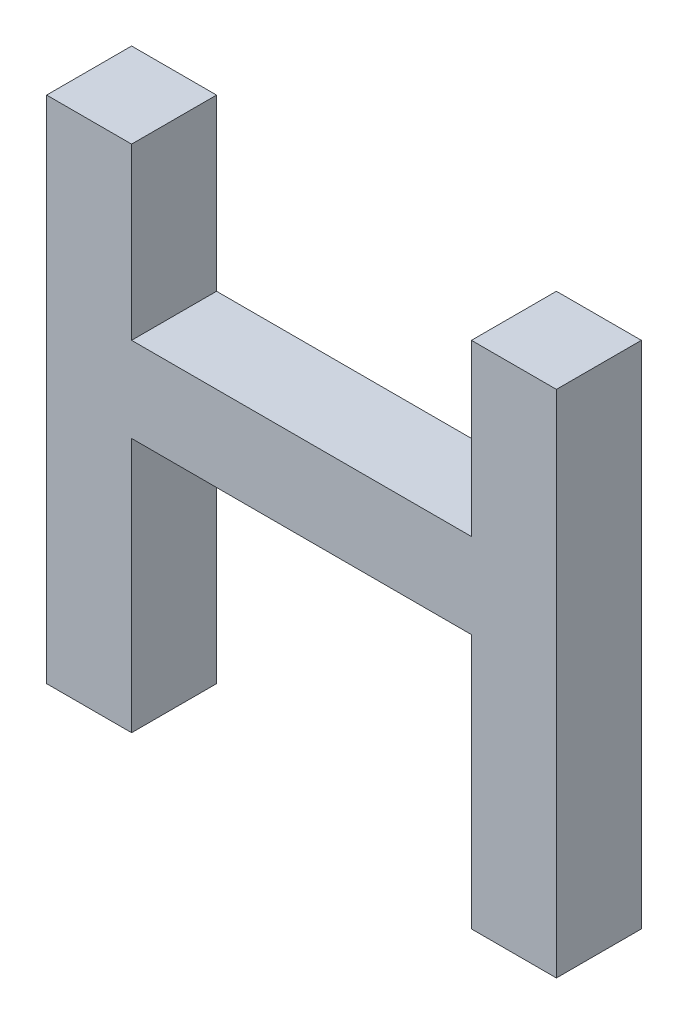
ISO-10303-21;
HEADER;
FILE_DESCRIPTION(('STEP AP214'),'2;1');
FILE_NAME('part.step','',(''),(''),'','','');
FILE_SCHEMA(('AUTOMOTIVE_DESIGN { 1 0 10303 214 1 1 1 1 }'));
ENDSEC;
DATA;
#1=APPLICATION_CONTEXT('core data for automotive mechanical design processes');
#2=APPLICATION_PROTOCOL_DEFINITION('international standard','automotive_design',2000,#1);
#3=PRODUCT_CONTEXT('',#1,'mechanical');
#4=PRODUCT('Part','Part','',(#3));
#5=PRODUCT_RELATED_PRODUCT_CATEGORY('part','',(#4));
#6=PRODUCT_DEFINITION_FORMATION('','',#4);
#7=PRODUCT_DEFINITION_CONTEXT('part definition',#1,'design');
#8=PRODUCT_DEFINITION('design','',#6,#7);
#9=PRODUCT_DEFINITION_SHAPE('','',#8);
#10=(LENGTH_UNIT() NAMED_UNIT(*) SI_UNIT(.MILLI.,.METRE.));
#11=(NAMED_UNIT(*) PLANE_ANGLE_UNIT() SI_UNIT($,.RADIAN.));
#12=(NAMED_UNIT(*) SI_UNIT($,.STERADIAN.) SOLID_ANGLE_UNIT());
#13=UNCERTAINTY_MEASURE_WITH_UNIT(LENGTH_MEASURE(1.E-05),#10,'distance_accuracy_value','');
#14=(GEOMETRIC_REPRESENTATION_CONTEXT(3) GLOBAL_UNCERTAINTY_ASSIGNED_CONTEXT((#13)) GLOBAL_UNIT_ASSIGNED_CONTEXT((#10,
#11,#12)) REPRESENTATION_CONTEXT('',''));
#15=CARTESIAN_POINT('',(0.,0.,0.));
#16=DIRECTION('',(0.,0.,1.));
#17=DIRECTION('',(1.,0.,0.));
#18=AXIS2_PLACEMENT_3D('',#15,#16,#17);
#19=CARTESIAN_POINT('',(-50.8,0.,25.4));
#20=DIRECTION('',(-1.,0.,0.));
#21=DIRECTION('',(0.,-1.,0.));
#22=AXIS2_PLACEMENT_3D('',#19,#20,#21);
#23=PLANE('',#22);
#24=DIRECTION('',(0.,1.,0.));
#25=VECTOR('',#24,1.);
#26=CARTESIAN_POINT('',(-50.8,0.,0.));
#27=LINE('',#26,#25);
#28=CARTESIAN_POINT('',(-50.8,-76.2,0.));
#29=VERTEX_POINT('',#28);
#30=CARTESIAN_POINT('',(-50.8,0.,0.));
#31=VERTEX_POINT('',#30);
#32=EDGE_CURVE('E154',#29,#31,#27,.T.);
#33=ORIENTED_EDGE('',*,*,#32,.T.);
#34=DIRECTION('',(0.,0.,-1.));
#35=VECTOR('',#34,1.);
#36=CARTESIAN_POINT('',(-50.8,0.,25.4));
#37=LINE('',#36,#35);
#38=CARTESIAN_POINT('',(-50.8,0.,25.4));
#39=VERTEX_POINT('',#38);
#40=EDGE_CURVE('E11',#39,#31,#37,.T.);
#41=ORIENTED_EDGE('',*,*,#40,.F.);
#42=DIRECTION('',(0.,1.,0.));
#43=VECTOR('',#42,1.);
#44=CARTESIAN_POINT('',(-50.8,0.,25.4));
#45=LINE('',#44,#43);
#46=CARTESIAN_POINT('',(-50.8,-76.2,25.4));
#47=VERTEX_POINT('',#46);
#48=EDGE_CURVE('E176',#47,#39,#45,.T.);
#49=ORIENTED_EDGE('',*,*,#48,.F.);
#50=DIRECTION('',(0.,0.,-1.));
#51=VECTOR('',#50,1.);
#52=CARTESIAN_POINT('',(-50.8,-76.2,25.4));
#53=LINE('',#52,#51);
#54=EDGE_CURVE('E150',#47,#29,#53,.T.);
#55=ORIENTED_EDGE('',*,*,#54,.T.);
#56=EDGE_LOOP('',(#33,#41,#49,#55));
#57=FACE_BOUND('',#56,.T.);
#58=ADVANCED_FACE('F34',(#57),#23,.F.);
#59=CARTESIAN_POINT('',(50.8,0.,25.4));
#60=DIRECTION('',(0.,1.,0.));
#61=DIRECTION('',(0.,0.,1.));
#62=AXIS2_PLACEMENT_3D('',#59,#60,#61);
#63=PLANE('',#62);
#64=DIRECTION('',(1.,0.,0.));
#65=VECTOR('',#64,1.);
#66=CARTESIAN_POINT('',(50.8,0.,0.));
#67=LINE('',#66,#65);
#68=CARTESIAN_POINT('',(50.8,0.,0.));
#69=VERTEX_POINT('',#68);
#70=EDGE_CURVE('E157',#31,#69,#67,.T.);
#71=ORIENTED_EDGE('',*,*,#70,.T.);
#72=DIRECTION('',(0.,0.,-1.));
#73=VECTOR('',#72,1.);
#74=CARTESIAN_POINT('',(50.8,0.,25.4));
#75=LINE('',#74,#73);
#76=CARTESIAN_POINT('',(50.8,0.,25.4));
#77=VERTEX_POINT('',#76);
#78=EDGE_CURVE('E42',#77,#69,#75,.T.);
#79=ORIENTED_EDGE('',*,*,#78,.F.);
#80=DIRECTION('',(1.,0.,0.));
#81=VECTOR('',#80,1.);
#82=CARTESIAN_POINT('',(50.8,0.,25.4));
#83=LINE('',#82,#81);
#84=EDGE_CURVE('E105',#39,#77,#83,.T.);
#85=ORIENTED_EDGE('',*,*,#84,.F.);
#86=ORIENTED_EDGE('',*,*,#40,.T.);
#87=EDGE_LOOP('',(#71,#79,#85,#86));
#88=FACE_BOUND('',#87,.T.);
#89=ADVANCED_FACE('F254',(#88),#63,.F.);
#90=CARTESIAN_POINT('',(50.8,0.,25.4));
#91=DIRECTION('',(1.,0.,0.));
#92=DIRECTION('',(0.,1.,0.));
#93=AXIS2_PLACEMENT_3D('',#90,#91,#92);
#94=PLANE('',#93);
#95=DIRECTION('',(0.,-1.,0.));
#96=VECTOR('',#95,1.);
#97=CARTESIAN_POINT('',(50.8,0.,0.));
#98=LINE('',#97,#96);
#99=CARTESIAN_POINT('',(50.8,-76.2,0.));
#100=VERTEX_POINT('',#99);
#101=EDGE_CURVE('E159',#69,#100,#98,.T.);
#102=ORIENTED_EDGE('',*,*,#101,.T.);
#103=DIRECTION('',(0.,0.,-1.));
#104=VECTOR('',#103,1.);
#105=CARTESIAN_POINT('',(50.8,-76.2,25.4));
#106=LINE('',#105,#104);
#107=CARTESIAN_POINT('',(50.8,-76.2,25.4));
#108=VERTEX_POINT('',#107);
#109=EDGE_CURVE('E195',#108,#100,#106,.T.);
#110=ORIENTED_EDGE('',*,*,#109,.F.);
#111=DIRECTION('',(0.,-1.,0.));
#112=VECTOR('',#111,1.);
#113=CARTESIAN_POINT('',(50.8,0.,25.4));
#114=LINE('',#113,#112);
#115=EDGE_CURVE('E203',#77,#108,#114,.T.);
#116=ORIENTED_EDGE('',*,*,#115,.F.);
#117=ORIENTED_EDGE('',*,*,#78,.T.);
#118=EDGE_LOOP('',(#102,#110,#116,#117));
#119=FACE_BOUND('',#118,.T.);
#120=ADVANCED_FACE('F201',(#119),#94,.F.);
#121=CARTESIAN_POINT('',(50.8,-76.2,25.4));
#122=DIRECTION('',(0.,1.,0.));
#123=DIRECTION('',(-1.,0.,0.));
#124=AXIS2_PLACEMENT_3D('',#121,#122,#123);
#125=PLANE('',#124);
#126=DIRECTION('',(1.,0.,0.));
#127=VECTOR('',#126,1.);
#128=CARTESIAN_POINT('',(50.8,-76.2,0.));
#129=LINE('',#128,#127);
#130=CARTESIAN_POINT('',(76.2,-76.2,0.));
#131=VERTEX_POINT('',#130);
#132=EDGE_CURVE('E161',#100,#131,#129,.T.);
#133=ORIENTED_EDGE('',*,*,#132,.T.);
#134=DIRECTION('',(0.,0.,-1.));
#135=VECTOR('',#134,1.);
#136=CARTESIAN_POINT('',(76.2,-76.2,25.4));
#137=LINE('',#136,#135);
#138=CARTESIAN_POINT('',(76.2,-76.2,25.4));
#139=VERTEX_POINT('',#138);
#140=EDGE_CURVE('E192',#139,#131,#137,.T.);
#141=ORIENTED_EDGE('',*,*,#140,.F.);
#142=DIRECTION('',(1.,0.,0.));
#143=VECTOR('',#142,1.);
#144=CARTESIAN_POINT('',(50.8,-76.2,25.4));
#145=LINE('',#144,#143);
#146=EDGE_CURVE('E221',#108,#139,#145,.T.);
#147=ORIENTED_EDGE('',*,*,#146,.F.);
#148=ORIENTED_EDGE('',*,*,#109,.T.);
#149=EDGE_LOOP('',(#133,#141,#147,#148));
#150=FACE_BOUND('',#149,.T.);
#151=ADVANCED_FACE('F212',(#150),#125,.F.);
#152=CARTESIAN_POINT('',(76.2,-76.2,25.4));
#153=DIRECTION('',(-1.,0.,0.));
#154=DIRECTION('',(0.,0.,1.));
#155=AXIS2_PLACEMENT_3D('',#152,#153,#154);
#156=PLANE('',#155);
#157=DIRECTION('',(0.,1.,0.));
#158=VECTOR('',#157,1.);
#159=CARTESIAN_POINT('',(76.2,-76.2,0.));
#160=LINE('',#159,#158);
#161=CARTESIAN_POINT('',(76.2,76.2,0.));
#162=VERTEX_POINT('',#161);
#163=EDGE_CURVE('E163',#131,#162,#160,.T.);
#164=ORIENTED_EDGE('',*,*,#163,.T.);
#165=DIRECTION('',(0.,0.,-1.));
#166=VECTOR('',#165,1.);
#167=CARTESIAN_POINT('',(76.2,76.2,25.4));
#168=LINE('',#167,#166);
#169=CARTESIAN_POINT('',(76.2,76.2,25.4));
#170=VERTEX_POINT('',#169);
#171=EDGE_CURVE('E189',#170,#162,#168,.T.);
#172=ORIENTED_EDGE('',*,*,#171,.F.);
#173=DIRECTION('',(0.,1.,0.));
#174=VECTOR('',#173,1.);
#175=CARTESIAN_POINT('',(76.2,-76.2,25.4));
#176=LINE('',#175,#174);
#177=EDGE_CURVE('E218',#139,#170,#176,.T.);
#178=ORIENTED_EDGE('',*,*,#177,.F.);
#179=ORIENTED_EDGE('',*,*,#140,.T.);
#180=EDGE_LOOP('',(#164,#172,#178,#179));
#181=FACE_BOUND('',#180,.T.);
#182=ADVANCED_FACE('F216',(#181),#156,.F.);
#183=CARTESIAN_POINT('',(76.2,76.2,25.4));
#184=DIRECTION('',(0.,-1.,0.));
#185=DIRECTION('',(0.,0.,-1.));
#186=AXIS2_PLACEMENT_3D('',#183,#184,#185);
#187=PLANE('',#186);
#188=DIRECTION('',(-1.,0.,0.));
#189=VECTOR('',#188,1.);
#190=CARTESIAN_POINT('',(76.2,76.2,0.));
#191=LINE('',#190,#189);
#192=CARTESIAN_POINT('',(50.8,76.2,0.));
#193=VERTEX_POINT('',#192);
#194=EDGE_CURVE('E165',#162,#193,#191,.T.);
#195=ORIENTED_EDGE('',*,*,#194,.T.);
#196=DIRECTION('',(0.,0.,-1.));
#197=VECTOR('',#196,1.);
#198=CARTESIAN_POINT('',(50.8,76.2,25.4));
#199=LINE('',#198,#197);
#200=CARTESIAN_POINT('',(50.8,76.2,25.4));
#201=VERTEX_POINT('',#200);
#202=EDGE_CURVE('E186',#201,#193,#199,.T.);
#203=ORIENTED_EDGE('',*,*,#202,.F.);
#204=DIRECTION('',(-1.,0.,0.));
#205=VECTOR('',#204,1.);
#206=CARTESIAN_POINT('',(76.2,76.2,25.4));
#207=LINE('',#206,#205);
#208=EDGE_CURVE('E220',#170,#201,#207,.T.);
#209=ORIENTED_EDGE('',*,*,#208,.F.);
#210=ORIENTED_EDGE('',*,*,#171,.T.);
#211=EDGE_LOOP('',(#195,#203,#209,#210));
#212=FACE_BOUND('',#211,.T.);
#213=ADVANCED_FACE('F267',(#212),#187,.F.);
#214=CARTESIAN_POINT('',(50.8,76.2,25.4));
#215=DIRECTION('',(1.,0.,0.));
#216=DIRECTION('',(0.,0.,-1.));
#217=AXIS2_PLACEMENT_3D('',#214,#215,#216);
#218=PLANE('',#217);
#219=DIRECTION('',(0.,-1.,0.));
#220=VECTOR('',#219,1.);
#221=CARTESIAN_POINT('',(50.8,76.2,0.));
#222=LINE('',#221,#220);
#223=CARTESIAN_POINT('',(50.8,25.4,0.));
#224=VERTEX_POINT('',#223);
#225=EDGE_CURVE('E167',#193,#224,#222,.T.);
#226=ORIENTED_EDGE('',*,*,#225,.T.);
#227=DIRECTION('',(0.,0.,-1.));
#228=VECTOR('',#227,1.);
#229=CARTESIAN_POINT('',(50.8,25.4,25.4));
#230=LINE('',#229,#228);
#231=CARTESIAN_POINT('',(50.8,25.4,25.4));
#232=VERTEX_POINT('',#231);
#233=EDGE_CURVE('E183',#232,#224,#230,.T.);
#234=ORIENTED_EDGE('',*,*,#233,.F.);
#235=DIRECTION('',(0.,-1.,0.));
#236=VECTOR('',#235,1.);
#237=CARTESIAN_POINT('',(50.8,76.2,25.4));
#238=LINE('',#237,#236);
#239=EDGE_CURVE('E223',#201,#232,#238,.T.);
#240=ORIENTED_EDGE('',*,*,#239,.F.);
#241=ORIENTED_EDGE('',*,*,#202,.T.);
#242=EDGE_LOOP('',(#226,#234,#240,#241));
#243=FACE_BOUND('',#242,.T.);
#244=ADVANCED_FACE('F270',(#243),#218,.F.);
#245=CARTESIAN_POINT('',(-50.8,25.4,25.4));
#246=DIRECTION('',(0.,-1.,0.));
#247=DIRECTION('',(0.,0.,-1.));
#248=AXIS2_PLACEMENT_3D('',#245,#246,#247);
#249=PLANE('',#248);
#250=DIRECTION('',(-1.,0.,0.));
#251=VECTOR('',#250,1.);
#252=CARTESIAN_POINT('',(-50.8,25.4,0.));
#253=LINE('',#252,#251);
#254=CARTESIAN_POINT('',(-50.8,25.4,0.));
#255=VERTEX_POINT('',#254);
#256=EDGE_CURVE('E169',#224,#255,#253,.T.);
#257=ORIENTED_EDGE('',*,*,#256,.T.);
#258=DIRECTION('',(0.,0.,-1.));
#259=VECTOR('',#258,1.);
#260=CARTESIAN_POINT('',(-50.8,25.4,25.4));
#261=LINE('',#260,#259);
#262=CARTESIAN_POINT('',(-50.8,25.4,25.4));
#263=VERTEX_POINT('',#262);
#264=EDGE_CURVE('E180',#263,#255,#261,.T.);
#265=ORIENTED_EDGE('',*,*,#264,.F.);
#266=DIRECTION('',(-1.,0.,0.));
#267=VECTOR('',#266,1.);
#268=CARTESIAN_POINT('',(-50.8,25.4,25.4));
#269=LINE('',#268,#267);
#270=EDGE_CURVE('E229',#232,#263,#269,.T.);
#271=ORIENTED_EDGE('',*,*,#270,.F.);
#272=ORIENTED_EDGE('',*,*,#233,.T.);
#273=EDGE_LOOP('',(#257,#265,#271,#272));
#274=FACE_BOUND('',#273,.T.);
#275=ADVANCED_FACE('F235',(#274),#249,.F.);
#276=CARTESIAN_POINT('',(-50.8,76.2,25.4));
#277=DIRECTION('',(-1.,0.,0.));
#278=DIRECTION('',(0.,0.,1.));
#279=AXIS2_PLACEMENT_3D('',#276,#277,#278);
#280=PLANE('',#279);
#281=DIRECTION('',(0.,1.,0.));
#282=VECTOR('',#281,1.);
#283=CARTESIAN_POINT('',(-50.8,76.2,0.));
#284=LINE('',#283,#282);
#285=CARTESIAN_POINT('',(-50.8,76.2,0.));
#286=VERTEX_POINT('',#285);
#287=EDGE_CURVE('E171',#255,#286,#284,.T.);
#288=ORIENTED_EDGE('',*,*,#287,.T.);
#289=DIRECTION('',(0.,0.,-1.));
#290=VECTOR('',#289,1.);
#291=CARTESIAN_POINT('',(-50.8,76.2,25.4));
#292=LINE('',#291,#290);
#293=CARTESIAN_POINT('',(-50.8,76.2,25.4));
#294=VERTEX_POINT('',#293);
#295=EDGE_CURVE('E145',#294,#286,#292,.T.);
#296=ORIENTED_EDGE('',*,*,#295,.F.);
#297=DIRECTION('',(0.,1.,0.));
#298=VECTOR('',#297,1.);
#299=CARTESIAN_POINT('',(-50.8,76.2,25.4));
#300=LINE('',#299,#298);
#301=EDGE_CURVE('E136',#263,#294,#300,.T.);
#302=ORIENTED_EDGE('',*,*,#301,.F.);
#303=ORIENTED_EDGE('',*,*,#264,.T.);
#304=EDGE_LOOP('',(#288,#296,#302,#303));
#305=FACE_BOUND('',#304,.T.);
#306=ADVANCED_FACE('F239',(#305),#280,.F.);
#307=CARTESIAN_POINT('',(-76.2,76.2,25.4));
#308=DIRECTION('',(0.,-1.,0.));
#309=DIRECTION('',(0.,0.,-1.));
#310=AXIS2_PLACEMENT_3D('',#307,#308,#309);
#311=PLANE('',#310);
#312=DIRECTION('',(-1.,0.,0.));
#313=VECTOR('',#312,1.);
#314=CARTESIAN_POINT('',(-76.2,76.2,0.));
#315=LINE('',#314,#313);
#316=CARTESIAN_POINT('',(-76.2,76.2,0.));
#317=VERTEX_POINT('',#316);
#318=EDGE_CURVE('E144',#286,#317,#315,.T.);
#319=ORIENTED_EDGE('',*,*,#318,.T.);
#320=DIRECTION('',(0.,0.,-1.));
#321=VECTOR('',#320,1.);
#322=CARTESIAN_POINT('',(-76.2,76.2,25.4));
#323=LINE('',#322,#321);
#324=CARTESIAN_POINT('',(-76.2,76.2,25.4));
#325=VERTEX_POINT('',#324);
#326=EDGE_CURVE('E141',#325,#317,#323,.T.);
#327=ORIENTED_EDGE('',*,*,#326,.F.);
#328=DIRECTION('',(-1.,0.,0.));
#329=VECTOR('',#328,1.);
#330=CARTESIAN_POINT('',(-76.2,76.2,25.4));
#331=LINE('',#330,#329);
#332=EDGE_CURVE('E130',#294,#325,#331,.T.);
#333=ORIENTED_EDGE('',*,*,#332,.F.);
#334=ORIENTED_EDGE('',*,*,#295,.T.);
#335=EDGE_LOOP('',(#319,#327,#333,#334));
#336=FACE_BOUND('',#335,.T.);
#337=ADVANCED_FACE('F142',(#336),#311,.F.);
#338=CARTESIAN_POINT('',(-76.2,-76.2,25.4));
#339=DIRECTION('',(1.,0.,0.));
#340=DIRECTION('',(0.,0.,-1.));
#341=AXIS2_PLACEMENT_3D('',#338,#339,#340);
#342=PLANE('',#341);
#343=DIRECTION('',(0.,-1.,0.));
#344=VECTOR('',#343,1.);
#345=CARTESIAN_POINT('',(-76.2,-76.2,0.));
#346=LINE('',#345,#344);
#347=CARTESIAN_POINT('',(-76.2,-76.2,0.));
#348=VERTEX_POINT('',#347);
#349=EDGE_CURVE('E91',#317,#348,#346,.T.);
#350=ORIENTED_EDGE('',*,*,#349,.T.);
#351=DIRECTION('',(0.,0.,-1.));
#352=VECTOR('',#351,1.);
#353=CARTESIAN_POINT('',(-76.2,-76.2,25.4));
#354=LINE('',#353,#352);
#355=CARTESIAN_POINT('',(-76.2,-76.2,25.4));
#356=VERTEX_POINT('',#355);
#357=EDGE_CURVE('E146',#356,#348,#354,.T.);
#358=ORIENTED_EDGE('',*,*,#357,.F.);
#359=DIRECTION('',(0.,-1.,0.));
#360=VECTOR('',#359,1.);
#361=CARTESIAN_POINT('',(-76.2,-76.2,25.4));
#362=LINE('',#361,#360);
#363=EDGE_CURVE('E134',#325,#356,#362,.T.);
#364=ORIENTED_EDGE('',*,*,#363,.F.);
#365=ORIENTED_EDGE('',*,*,#326,.T.);
#366=EDGE_LOOP('',(#350,#358,#364,#365));
#367=FACE_BOUND('',#366,.T.);
#368=ADVANCED_FACE('F148',(#367),#342,.F.);
#369=CARTESIAN_POINT('',(-50.8,-76.2,25.4));
#370=DIRECTION('',(0.,1.,0.));
#371=DIRECTION('',(-1.,0.,0.));
#372=AXIS2_PLACEMENT_3D('',#369,#370,#371);
#373=PLANE('',#372);
#374=DIRECTION('',(1.,0.,0.));
#375=VECTOR('',#374,1.);
#376=CARTESIAN_POINT('',(-50.8,-76.2,0.));
#377=LINE('',#376,#375);
#378=EDGE_CURVE('E97',#348,#29,#377,.T.);
#379=ORIENTED_EDGE('',*,*,#378,.T.);
#380=ORIENTED_EDGE('',*,*,#54,.F.);
#381=DIRECTION('',(1.,0.,0.));
#382=VECTOR('',#381,1.);
#383=CARTESIAN_POINT('',(-50.8,-76.2,25.4));
#384=LINE('',#383,#382);
#385=EDGE_CURVE('E50',#356,#47,#384,.T.);
#386=ORIENTED_EDGE('',*,*,#385,.F.);
#387=ORIENTED_EDGE('',*,*,#357,.T.);
#388=EDGE_LOOP('',(#379,#380,#386,#387));
#389=FACE_BOUND('',#388,.T.);
#390=ADVANCED_FACE('F243',(#389),#373,.F.);
#391=CARTESIAN_POINT('',(0.,0.,25.4));
#392=DIRECTION('',(0.,0.,-1.));
#393=DIRECTION('',(-1.,0.,0.));
#394=AXIS2_PLACEMENT_3D('',#391,#392,#393);
#395=PLANE('',#394);
#396=ORIENTED_EDGE('',*,*,#48,.T.);
#397=ORIENTED_EDGE('',*,*,#84,.T.);
#398=ORIENTED_EDGE('',*,*,#115,.T.);
#399=ORIENTED_EDGE('',*,*,#146,.T.);
#400=ORIENTED_EDGE('',*,*,#177,.T.);
#401=ORIENTED_EDGE('',*,*,#208,.T.);
#402=ORIENTED_EDGE('',*,*,#239,.T.);
#403=ORIENTED_EDGE('',*,*,#270,.T.);
#404=ORIENTED_EDGE('',*,*,#301,.T.);
#405=ORIENTED_EDGE('',*,*,#332,.T.);
#406=ORIENTED_EDGE('',*,*,#363,.T.);
#407=ORIENTED_EDGE('',*,*,#385,.T.);
#408=EDGE_LOOP('',(#396,#397,#398,#399,#400,#401,#402,#403,#404,#405,#406,#407));
#409=FACE_BOUND('',#408,.T.);
#410=ADVANCED_FACE('F132',(#409),#395,.F.);
#411=CARTESIAN_POINT('',(0.,0.,0.));
#412=DIRECTION('',(0.,0.,-1.));
#413=DIRECTION('',(-1.,0.,0.));
#414=AXIS2_PLACEMENT_3D('',#411,#412,#413);
#415=PLANE('',#414);
#416=ORIENTED_EDGE('',*,*,#32,.F.);
#417=ORIENTED_EDGE('',*,*,#378,.F.);
#418=ORIENTED_EDGE('',*,*,#349,.F.);
#419=ORIENTED_EDGE('',*,*,#318,.F.);
#420=ORIENTED_EDGE('',*,*,#287,.F.);
#421=ORIENTED_EDGE('',*,*,#256,.F.);
#422=ORIENTED_EDGE('',*,*,#225,.F.);
#423=ORIENTED_EDGE('',*,*,#194,.F.);
#424=ORIENTED_EDGE('',*,*,#163,.F.);
#425=ORIENTED_EDGE('',*,*,#132,.F.);
#426=ORIENTED_EDGE('',*,*,#101,.F.);
#427=ORIENTED_EDGE('',*,*,#70,.F.);
#428=EDGE_LOOP('',(#416,#417,#418,#419,#420,#421,#422,#423,#424,#425,#426,#427));
#429=FACE_BOUND('',#428,.T.);
#430=ADVANCED_FACE('F207',(#429),#415,.T.);
#431=CLOSED_SHELL('',(#58,#89,#120,#151,#182,#213,#244,#275,#306,#337,#368,#390,#410,#430));
#432=MANIFOLD_SOLID_BREP('B2',#431);
#433=ADVANCED_BREP_SHAPE_REPRESENTATION('',(#18,#432),#14);
#434=SHAPE_DEFINITION_REPRESENTATION(#9,#433);
ENDSEC;
END-ISO-10303-21;
